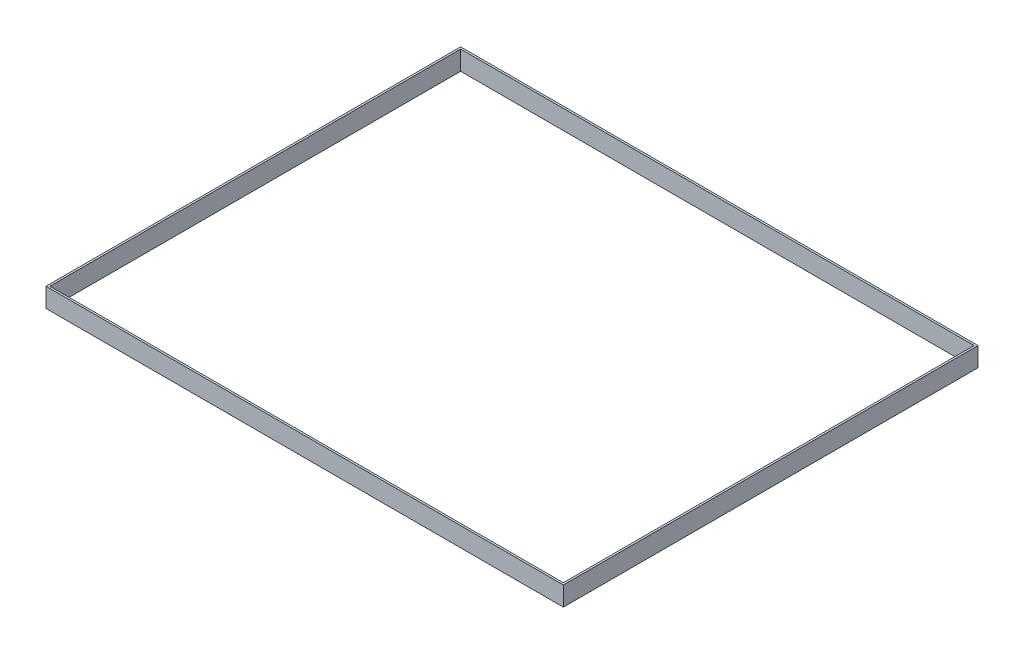
ISO-10303-21;
HEADER;
FILE_DESCRIPTION(('STEP AP214'),'2;1');
FILE_NAME('part.step','',(''),(''),'','','');
FILE_SCHEMA(('AUTOMOTIVE_DESIGN { 1 0 10303 214 1 1 1 1 }'));
ENDSEC;
DATA;
#1=APPLICATION_CONTEXT('core data for automotive mechanical design processes');
#2=APPLICATION_PROTOCOL_DEFINITION('international standard','automotive_design',2000,#1);
#3=PRODUCT_CONTEXT('',#1,'mechanical');
#4=PRODUCT('Part','Part','',(#3));
#5=PRODUCT_RELATED_PRODUCT_CATEGORY('part','',(#4));
#6=PRODUCT_DEFINITION_FORMATION('','',#4);
#7=PRODUCT_DEFINITION_CONTEXT('part definition',#1,'design');
#8=PRODUCT_DEFINITION('design','',#6,#7);
#9=PRODUCT_DEFINITION_SHAPE('','',#8);
#10=(LENGTH_UNIT() NAMED_UNIT(*) SI_UNIT(.MILLI.,.METRE.));
#11=(NAMED_UNIT(*) PLANE_ANGLE_UNIT() SI_UNIT($,.RADIAN.));
#12=(NAMED_UNIT(*) SI_UNIT($,.STERADIAN.) SOLID_ANGLE_UNIT());
#13=UNCERTAINTY_MEASURE_WITH_UNIT(LENGTH_MEASURE(1.E-05),#10,'distance_accuracy_value','');
#14=(GEOMETRIC_REPRESENTATION_CONTEXT(3) GLOBAL_UNCERTAINTY_ASSIGNED_CONTEXT((#13)) GLOBAL_UNIT_ASSIGNED_CONTEXT((#10,
#11,#12)) REPRESENTATION_CONTEXT('',''));
#15=CARTESIAN_POINT('',(0.,0.,0.));
#16=DIRECTION('',(0.,0.,1.));
#17=DIRECTION('',(1.,0.,0.));
#18=AXIS2_PLACEMENT_3D('',#15,#16,#17);
#19=CARTESIAN_POINT('',(0.,150.,0.));
#20=DIRECTION('',(0.,-1.,0.));
#21=DIRECTION('',(0.,0.,-1.));
#22=AXIS2_PLACEMENT_3D('',#19,#20,#21);
#23=PLANE('',#22);
#24=DIRECTION('',(0.,0.,1.));
#25=VECTOR('',#24,1.);
#26=CARTESIAN_POINT('',(-15.,150.,15.));
#27=LINE('',#26,#25);
#28=CARTESIAN_POINT('',(-15.,150.,-3215.));
#29=VERTEX_POINT('',#28);
#30=CARTESIAN_POINT('',(-15.,150.,15.));
#31=VERTEX_POINT('',#30);
#32=EDGE_CURVE('E136',#29,#31,#27,.T.);
#33=ORIENTED_EDGE('',*,*,#32,.T.);
#34=DIRECTION('',(1.,0.,0.));
#35=VECTOR('',#34,1.);
#36=CARTESIAN_POINT('',(-15.,150.,15.));
#37=LINE('',#36,#35);
#38=CARTESIAN_POINT('',(4015.,150.,15.));
#39=VERTEX_POINT('',#38);
#40=EDGE_CURVE('E139',#31,#39,#37,.T.);
#41=ORIENTED_EDGE('',*,*,#40,.T.);
#42=DIRECTION('',(0.,0.,-1.));
#43=VECTOR('',#42,1.);
#44=CARTESIAN_POINT('',(4015.,150.,15.));
#45=LINE('',#44,#43);
#46=CARTESIAN_POINT('',(4015.,150.,-3215.));
#47=VERTEX_POINT('',#46);
#48=EDGE_CURVE('E142',#39,#47,#45,.T.);
#49=ORIENTED_EDGE('',*,*,#48,.T.);
#50=DIRECTION('',(-1.,0.,0.));
#51=VECTOR('',#50,1.);
#52=CARTESIAN_POINT('',(-15.,150.,-3215.));
#53=LINE('',#52,#51);
#54=EDGE_CURVE('E144',#47,#29,#53,.T.);
#55=ORIENTED_EDGE('',*,*,#54,.T.);
#56=EDGE_LOOP('',(#33,#41,#49,#55));
#57=FACE_BOUND('',#56,.T.);
#58=DIRECTION('',(0.,0.,1.));
#59=VECTOR('',#58,1.);
#60=CARTESIAN_POINT('',(0.,150.,0.));
#61=LINE('',#60,#59);
#62=CARTESIAN_POINT('',(0.,150.,-3200.));
#63=VERTEX_POINT('',#62);
#64=CARTESIAN_POINT('',(0.,150.,0.));
#65=VERTEX_POINT('',#64);
#66=EDGE_CURVE('E100',#63,#65,#61,.T.);
#67=ORIENTED_EDGE('',*,*,#66,.F.);
#68=DIRECTION('',(-1.,0.,0.));
#69=VECTOR('',#68,1.);
#70=CARTESIAN_POINT('',(0.,150.,-3200.));
#71=LINE('',#70,#69);
#72=CARTESIAN_POINT('',(4000.,150.,-3200.));
#73=VERTEX_POINT('',#72);
#74=EDGE_CURVE('E122',#73,#63,#71,.T.);
#75=ORIENTED_EDGE('',*,*,#74,.F.);
#76=DIRECTION('',(0.,0.,-1.));
#77=VECTOR('',#76,1.);
#78=CARTESIAN_POINT('',(4000.,150.,0.));
#79=LINE('',#78,#77);
#80=CARTESIAN_POINT('',(4000.,150.,0.));
#81=VERTEX_POINT('',#80);
#82=EDGE_CURVE('E120',#81,#73,#79,.T.);
#83=ORIENTED_EDGE('',*,*,#82,.F.);
#84=DIRECTION('',(1.,0.,0.));
#85=VECTOR('',#84,1.);
#86=CARTESIAN_POINT('',(0.,150.,0.));
#87=LINE('',#86,#85);
#88=EDGE_CURVE('E108',#65,#81,#87,.T.);
#89=ORIENTED_EDGE('',*,*,#88,.F.);
#90=EDGE_LOOP('',(#67,#75,#83,#89));
#91=FACE_BOUND('',#90,.T.);
#92=ADVANCED_FACE('F35',(#57,#91),#23,.F.);
#93=CARTESIAN_POINT('',(0.,0.,0.));
#94=DIRECTION('',(0.,-1.,0.));
#95=DIRECTION('',(0.,0.,-1.));
#96=AXIS2_PLACEMENT_3D('',#93,#94,#95);
#97=PLANE('',#96);
#98=DIRECTION('',(0.,0.,1.));
#99=VECTOR('',#98,1.);
#100=CARTESIAN_POINT('',(-15.,0.,15.));
#101=LINE('',#100,#99);
#102=CARTESIAN_POINT('',(-15.,0.,-3215.));
#103=VERTEX_POINT('',#102);
#104=CARTESIAN_POINT('',(-15.,0.,15.));
#105=VERTEX_POINT('',#104);
#106=EDGE_CURVE('E116',#103,#105,#101,.T.);
#107=ORIENTED_EDGE('',*,*,#106,.F.);
#108=DIRECTION('',(-1.,0.,0.));
#109=VECTOR('',#108,1.);
#110=CARTESIAN_POINT('',(-15.,0.,-3215.));
#111=LINE('',#110,#109);
#112=CARTESIAN_POINT('',(4015.,0.,-3215.));
#113=VERTEX_POINT('',#112);
#114=EDGE_CURVE('E140',#113,#103,#111,.T.);
#115=ORIENTED_EDGE('',*,*,#114,.F.);
#116=DIRECTION('',(0.,0.,-1.));
#117=VECTOR('',#116,1.);
#118=CARTESIAN_POINT('',(4015.,0.,15.));
#119=LINE('',#118,#117);
#120=CARTESIAN_POINT('',(4015.,0.,15.));
#121=VERTEX_POINT('',#120);
#122=EDGE_CURVE('E151',#121,#113,#119,.T.);
#123=ORIENTED_EDGE('',*,*,#122,.F.);
#124=DIRECTION('',(1.,0.,0.));
#125=VECTOR('',#124,1.);
#126=CARTESIAN_POINT('',(-15.,0.,15.));
#127=LINE('',#126,#125);
#128=EDGE_CURVE('E149',#105,#121,#127,.T.);
#129=ORIENTED_EDGE('',*,*,#128,.F.);
#130=EDGE_LOOP('',(#107,#115,#123,#129));
#131=FACE_BOUND('',#130,.T.);
#132=DIRECTION('',(-1.,0.,0.));
#133=VECTOR('',#132,1.);
#134=CARTESIAN_POINT('',(0.,0.,-3200.));
#135=LINE('',#134,#133);
#136=CARTESIAN_POINT('',(4000.,0.,-3200.));
#137=VERTEX_POINT('',#136);
#138=CARTESIAN_POINT('',(0.,0.,-3200.));
#139=VERTEX_POINT('',#138);
#140=EDGE_CURVE('E109',#137,#139,#135,.T.);
#141=ORIENTED_EDGE('',*,*,#140,.T.);
#142=DIRECTION('',(0.,0.,1.));
#143=VECTOR('',#142,1.);
#144=CARTESIAN_POINT('',(0.,0.,0.));
#145=LINE('',#144,#143);
#146=CARTESIAN_POINT('',(0.,0.,0.));
#147=VERTEX_POINT('',#146);
#148=EDGE_CURVE('E58',#139,#147,#145,.T.);
#149=ORIENTED_EDGE('',*,*,#148,.T.);
#150=DIRECTION('',(1.,0.,0.));
#151=VECTOR('',#150,1.);
#152=CARTESIAN_POINT('',(0.,0.,0.));
#153=LINE('',#152,#151);
#154=CARTESIAN_POINT('',(4000.,0.,0.));
#155=VERTEX_POINT('',#154);
#156=EDGE_CURVE('E115',#147,#155,#153,.T.);
#157=ORIENTED_EDGE('',*,*,#156,.T.);
#158=DIRECTION('',(0.,0.,-1.));
#159=VECTOR('',#158,1.);
#160=CARTESIAN_POINT('',(4000.,0.,0.));
#161=LINE('',#160,#159);
#162=EDGE_CURVE('E128',#155,#137,#161,.T.);
#163=ORIENTED_EDGE('',*,*,#162,.T.);
#164=EDGE_LOOP('',(#141,#149,#157,#163));
#165=FACE_BOUND('',#164,.T.);
#166=ADVANCED_FACE('F169',(#131,#165),#97,.T.);
#167=CARTESIAN_POINT('',(-15.,150.,15.));
#168=DIRECTION('',(1.,0.,0.));
#169=DIRECTION('',(0.,0.,-1.));
#170=AXIS2_PLACEMENT_3D('',#167,#168,#169);
#171=PLANE('',#170);
#172=ORIENTED_EDGE('',*,*,#106,.T.);
#173=DIRECTION('',(0.,-1.,0.));
#174=VECTOR('',#173,1.);
#175=CARTESIAN_POINT('',(-15.,150.,15.));
#176=LINE('',#175,#174);
#177=EDGE_CURVE('E11',#31,#105,#176,.T.);
#178=ORIENTED_EDGE('',*,*,#177,.F.);
#179=ORIENTED_EDGE('',*,*,#32,.F.);
#180=DIRECTION('',(0.,-1.,0.));
#181=VECTOR('',#180,1.);
#182=CARTESIAN_POINT('',(-15.,150.,-3215.));
#183=LINE('',#182,#181);
#184=EDGE_CURVE('E146',#29,#103,#183,.T.);
#185=ORIENTED_EDGE('',*,*,#184,.T.);
#186=EDGE_LOOP('',(#172,#178,#179,#185));
#187=FACE_BOUND('',#186,.T.);
#188=ADVANCED_FACE('F37',(#187),#171,.F.);
#189=CARTESIAN_POINT('',(-15.,150.,15.));
#190=DIRECTION('',(0.,0.,-1.));
#191=DIRECTION('',(-1.,0.,0.));
#192=AXIS2_PLACEMENT_3D('',#189,#190,#191);
#193=PLANE('',#192);
#194=ORIENTED_EDGE('',*,*,#128,.T.);
#195=DIRECTION('',(0.,-1.,0.));
#196=VECTOR('',#195,1.);
#197=CARTESIAN_POINT('',(4015.,150.,15.));
#198=LINE('',#197,#196);
#199=EDGE_CURVE('E43',#39,#121,#198,.T.);
#200=ORIENTED_EDGE('',*,*,#199,.F.);
#201=ORIENTED_EDGE('',*,*,#40,.F.);
#202=ORIENTED_EDGE('',*,*,#177,.T.);
#203=EDGE_LOOP('',(#194,#200,#201,#202));
#204=FACE_BOUND('',#203,.T.);
#205=ADVANCED_FACE('F179',(#204),#193,.F.);
#206=CARTESIAN_POINT('',(4015.,150.,15.));
#207=DIRECTION('',(-1.,0.,0.));
#208=DIRECTION('',(0.,0.,1.));
#209=AXIS2_PLACEMENT_3D('',#206,#207,#208);
#210=PLANE('',#209);
#211=ORIENTED_EDGE('',*,*,#122,.T.);
#212=DIRECTION('',(0.,-1.,0.));
#213=VECTOR('',#212,1.);
#214=CARTESIAN_POINT('',(4015.,150.,-3215.));
#215=LINE('',#214,#213);
#216=EDGE_CURVE('E156',#47,#113,#215,.T.);
#217=ORIENTED_EDGE('',*,*,#216,.F.);
#218=ORIENTED_EDGE('',*,*,#48,.F.);
#219=ORIENTED_EDGE('',*,*,#199,.T.);
#220=EDGE_LOOP('',(#211,#217,#218,#219));
#221=FACE_BOUND('',#220,.T.);
#222=ADVANCED_FACE('F163',(#221),#210,.F.);
#223=CARTESIAN_POINT('',(-15.,150.,-3215.));
#224=DIRECTION('',(0.,0.,1.));
#225=DIRECTION('',(1.,0.,0.));
#226=AXIS2_PLACEMENT_3D('',#223,#224,#225);
#227=PLANE('',#226);
#228=ORIENTED_EDGE('',*,*,#114,.T.);
#229=ORIENTED_EDGE('',*,*,#184,.F.);
#230=ORIENTED_EDGE('',*,*,#54,.F.);
#231=ORIENTED_EDGE('',*,*,#216,.T.);
#232=EDGE_LOOP('',(#228,#229,#230,#231));
#233=FACE_BOUND('',#232,.T.);
#234=ADVANCED_FACE('F173',(#233),#227,.F.);
#235=CARTESIAN_POINT('',(0.,150.,0.));
#236=DIRECTION('',(1.,0.,0.));
#237=DIRECTION('',(0.,0.,-1.));
#238=AXIS2_PLACEMENT_3D('',#235,#236,#237);
#239=PLANE('',#238);
#240=ORIENTED_EDGE('',*,*,#148,.F.);
#241=DIRECTION('',(0.,-1.,0.));
#242=VECTOR('',#241,1.);
#243=CARTESIAN_POINT('',(0.,150.,-3200.));
#244=LINE('',#243,#242);
#245=EDGE_CURVE('E104',#63,#139,#244,.T.);
#246=ORIENTED_EDGE('',*,*,#245,.F.);
#247=ORIENTED_EDGE('',*,*,#66,.T.);
#248=DIRECTION('',(0.,-1.,0.));
#249=VECTOR('',#248,1.);
#250=CARTESIAN_POINT('',(0.,150.,0.));
#251=LINE('',#250,#249);
#252=EDGE_CURVE('E103',#65,#147,#251,.T.);
#253=ORIENTED_EDGE('',*,*,#252,.T.);
#254=EDGE_LOOP('',(#240,#246,#247,#253));
#255=FACE_BOUND('',#254,.T.);
#256=ADVANCED_FACE('F102',(#255),#239,.T.);
#257=CARTESIAN_POINT('',(0.,150.,0.));
#258=DIRECTION('',(0.,0.,-1.));
#259=DIRECTION('',(-1.,0.,0.));
#260=AXIS2_PLACEMENT_3D('',#257,#258,#259);
#261=PLANE('',#260);
#262=ORIENTED_EDGE('',*,*,#156,.F.);
#263=ORIENTED_EDGE('',*,*,#252,.F.);
#264=ORIENTED_EDGE('',*,*,#88,.T.);
#265=DIRECTION('',(0.,-1.,0.));
#266=VECTOR('',#265,1.);
#267=CARTESIAN_POINT('',(4000.,150.,0.));
#268=LINE('',#267,#266);
#269=EDGE_CURVE('E117',#81,#155,#268,.T.);
#270=ORIENTED_EDGE('',*,*,#269,.T.);
#271=EDGE_LOOP('',(#262,#263,#264,#270));
#272=FACE_BOUND('',#271,.T.);
#273=ADVANCED_FACE('F112',(#272),#261,.T.);
#274=CARTESIAN_POINT('',(4000.,150.,0.));
#275=DIRECTION('',(-1.,0.,0.));
#276=DIRECTION('',(0.,0.,1.));
#277=AXIS2_PLACEMENT_3D('',#274,#275,#276);
#278=PLANE('',#277);
#279=ORIENTED_EDGE('',*,*,#162,.F.);
#280=ORIENTED_EDGE('',*,*,#269,.F.);
#281=ORIENTED_EDGE('',*,*,#82,.T.);
#282=DIRECTION('',(0.,-1.,0.));
#283=VECTOR('',#282,1.);
#284=CARTESIAN_POINT('',(4000.,150.,-3200.));
#285=LINE('',#284,#283);
#286=EDGE_CURVE('E50',#73,#137,#285,.T.);
#287=ORIENTED_EDGE('',*,*,#286,.T.);
#288=EDGE_LOOP('',(#279,#280,#281,#287));
#289=FACE_BOUND('',#288,.T.);
#290=ADVANCED_FACE('F202',(#289),#278,.T.);
#291=CARTESIAN_POINT('',(0.,150.,-3200.));
#292=DIRECTION('',(0.,0.,1.));
#293=DIRECTION('',(1.,0.,0.));
#294=AXIS2_PLACEMENT_3D('',#291,#292,#293);
#295=PLANE('',#294);
#296=ORIENTED_EDGE('',*,*,#140,.F.);
#297=ORIENTED_EDGE('',*,*,#286,.F.);
#298=ORIENTED_EDGE('',*,*,#74,.T.);
#299=ORIENTED_EDGE('',*,*,#245,.T.);
#300=EDGE_LOOP('',(#296,#297,#298,#299));
#301=FACE_BOUND('',#300,.T.);
#302=ADVANCED_FACE('F206',(#301),#295,.T.);
#303=CLOSED_SHELL('',(#92,#166,#188,#205,#222,#234,#256,#273,#290,#302));
#304=MANIFOLD_SOLID_BREP('B2',#303);
#305=ADVANCED_BREP_SHAPE_REPRESENTATION('',(#18,#304),#14);
#306=SHAPE_DEFINITION_REPRESENTATION(#9,#305);
ENDSEC;
END-ISO-10303-21;
